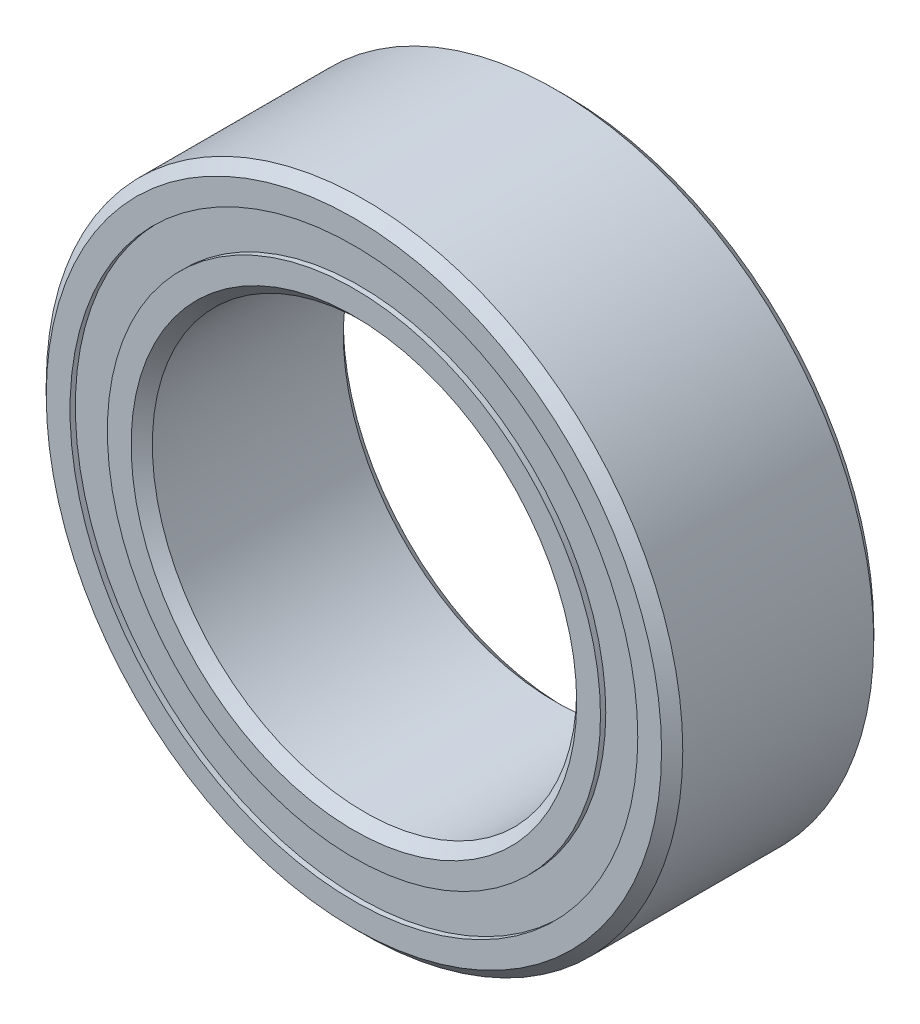
ISO-10303-21;
HEADER;
FILE_DESCRIPTION(('STEP AP214'),'2;1');
FILE_NAME('part.step','',(''),(''),'','','');
FILE_SCHEMA(('AUTOMOTIVE_DESIGN { 1 0 10303 214 1 1 1 1 }'));
ENDSEC;
DATA;
#1=APPLICATION_CONTEXT('core data for automotive mechanical design processes');
#2=APPLICATION_PROTOCOL_DEFINITION('international standard','automotive_design',2000,#1);
#3=PRODUCT_CONTEXT('',#1,'mechanical');
#4=PRODUCT('Part','Part','',(#3));
#5=PRODUCT_RELATED_PRODUCT_CATEGORY('part','',(#4));
#6=PRODUCT_DEFINITION_FORMATION('','',#4);
#7=PRODUCT_DEFINITION_CONTEXT('part definition',#1,'design');
#8=PRODUCT_DEFINITION('design','',#6,#7);
#9=PRODUCT_DEFINITION_SHAPE('','',#8);
#10=(LENGTH_UNIT() NAMED_UNIT(*) SI_UNIT(.MILLI.,.METRE.));
#11=(NAMED_UNIT(*) PLANE_ANGLE_UNIT() SI_UNIT($,.RADIAN.));
#12=(NAMED_UNIT(*) SI_UNIT($,.STERADIAN.) SOLID_ANGLE_UNIT());
#13=UNCERTAINTY_MEASURE_WITH_UNIT(LENGTH_MEASURE(1.E-05),#10,'distance_accuracy_value','');
#14=(GEOMETRIC_REPRESENTATION_CONTEXT(3) GLOBAL_UNCERTAINTY_ASSIGNED_CONTEXT((#13)) GLOBAL_UNIT_ASSIGNED_CONTEXT((#10,
#11,#12)) REPRESENTATION_CONTEXT('',''));
#15=CARTESIAN_POINT('',(0.,0.,0.));
#16=DIRECTION('',(0.,0.,1.));
#17=DIRECTION('',(1.,0.,0.));
#18=AXIS2_PLACEMENT_3D('',#15,#16,#17);
#19=CARTESIAN_POINT('',(0.,3.96875,0.));
#20=DIRECTION('',(0.,1.,0.));
#21=DIRECTION('',(0.,0.,-1.));
#22=AXIS2_PLACEMENT_3D('',#19,#20,#21);
#23=SPHERICAL_SURFACE('',#22,0.758760243513404);
#24=CARTESIAN_POINT('',(0.,3.2099897564866,0.));
#25=VERTEX_POINT('',#24);
#26=VERTEX_LOOP('',#25);
#27=FACE_BOUND('',#26,.T.);
#28=CARTESIAN_POINT('',(0.,4.7275102435134,0.));
#29=VERTEX_POINT('',#28);
#30=VERTEX_LOOP('',#29);
#31=FACE_BOUND('',#30,.T.);
#32=ADVANCED_FACE('P0_F16',(#27,#31),#23,.T.);
#33=CLOSED_SHELL('',(#32));
#34=MANIFOLD_SOLID_BREP('P0_B1',#33);
#35=CARTESIAN_POINT('',(-1.98437500000003,-3.43703832126947,0.));
#36=DIRECTION('',(-0.500000000000007,-0.866025403784435,0.));
#37=DIRECTION('',(0.,0.,-1.));
#38=AXIS2_PLACEMENT_3D('',#35,#36,#37);
#39=SPHERICAL_SURFACE('',#38,0.758760243513404);
#40=CARTESIAN_POINT('',(-2.36375512175674,-4.09414396753375,0.));
#41=VERTEX_POINT('',#40);
#42=VERTEX_LOOP('',#41);
#43=FACE_BOUND('',#42,.T.);
#44=CARTESIAN_POINT('',(-1.60499487824332,-2.7799326750052,0.));
#45=VERTEX_POINT('',#44);
#46=VERTEX_LOOP('',#45);
#47=FACE_BOUND('',#46,.T.);
#48=ADVANCED_FACE('P1_F16',(#43,#47),#39,.T.);
#49=CLOSED_SHELL('',(#48));
#50=MANIFOLD_SOLID_BREP('P1_B1',#49);
#51=CARTESIAN_POINT('',(0.,0.,0.));
#52=DIRECTION('',(0.,0.,1.));
#53=DIRECTION('',(1.,0.,0.));
#54=AXIS2_PLACEMENT_3D('',#51,#52,#53);
#55=TOROIDAL_SURFACE('',#54,3.96875,0.758760243513404);
#56=CARTESIAN_POINT('',(0.,0.,-0.705555555555556));
#57=DIRECTION('',(0.,0.,1.));
#58=DIRECTION('',(1.,0.,0.));
#59=AXIS2_PLACEMENT_3D('',#56,#57,#58);
#60=CIRCLE('',#59,4.24787087912088);
#61=CARTESIAN_POINT('',(4.24787087912088,0.,-0.705555555555556));
#62=VERTEX_POINT('',#61);
#63=EDGE_CURVE('P2_E33',#62,#62,#60,.F.);
#64=ORIENTED_EDGE('',*,*,#63,.T.);
#65=EDGE_LOOP('',(#64));
#66=FACE_BOUND('',#65,.T.);
#67=CARTESIAN_POINT('',(0.,0.,0.705555555555555));
#68=DIRECTION('',(0.,0.,1.));
#69=DIRECTION('',(1.,0.,0.));
#70=AXIS2_PLACEMENT_3D('',#67,#68,#69);
#71=CIRCLE('',#70,4.24787087912088);
#72=CARTESIAN_POINT('',(4.24787087912088,0.,0.705555555555555));
#73=VERTEX_POINT('',#72);
#74=EDGE_CURVE('P2_E31',#73,#73,#71,.T.);
#75=ORIENTED_EDGE('',*,*,#74,.T.);
#76=EDGE_LOOP('',(#75));
#77=FACE_BOUND('',#76,.T.);
#78=ADVANCED_FACE('P2_F15',(#66,#77),#55,.F.);
#79=CARTESIAN_POINT('',(0.,0.,1.5875));
#80=DIRECTION('',(0.,0.,1.));
#81=DIRECTION('',(1.,0.,0.));
#82=AXIS2_PLACEMENT_3D('',#79,#80,#81);
#83=CYLINDRICAL_SURFACE('',#82,4.24787087912088);
#84=CARTESIAN_POINT('',(0.,0.,-1.5875));
#85=DIRECTION('',(0.,0.,1.));
#86=DIRECTION('',(1.,0.,0.));
#87=AXIS2_PLACEMENT_3D('',#84,#85,#86);
#88=CIRCLE('',#87,4.24787087912088);
#89=CARTESIAN_POINT('',(4.24787087912088,0.,-1.5875));
#90=VERTEX_POINT('',#89);
#91=EDGE_CURVE('P2_E19',#90,#90,#88,.F.);
#92=ORIENTED_EDGE('',*,*,#91,.T.);
#93=EDGE_LOOP('',(#92));
#94=FACE_BOUND('',#93,.T.);
#95=ORIENTED_EDGE('',*,*,#63,.F.);
#96=EDGE_LOOP('',(#95));
#97=FACE_BOUND('',#96,.T.);
#98=ADVANCED_FACE('P2_F49',(#94,#97),#83,.F.);
#99=CARTESIAN_POINT('',(0.,0.,1.5875));
#100=DIRECTION('',(0.,0.,1.));
#101=DIRECTION('',(1.,0.,0.));
#102=AXIS2_PLACEMENT_3D('',#99,#100,#101);
#103=CYLINDRICAL_SURFACE('',#102,4.24787087912088);
#104=ORIENTED_EDGE('',*,*,#74,.F.);
#105=EDGE_LOOP('',(#104));
#106=FACE_BOUND('',#105,.T.);
#107=CARTESIAN_POINT('',(0.,0.,1.5875));
#108=DIRECTION('',(0.,0.,1.));
#109=DIRECTION('',(1.,0.,0.));
#110=AXIS2_PLACEMENT_3D('',#107,#108,#109);
#111=CIRCLE('',#110,4.24787087912088);
#112=CARTESIAN_POINT('',(4.24787087912088,0.,1.5875));
#113=VERTEX_POINT('',#112);
#114=EDGE_CURVE('P2_E42',#113,#113,#111,.T.);
#115=ORIENTED_EDGE('',*,*,#114,.T.);
#116=EDGE_LOOP('',(#115));
#117=FACE_BOUND('',#116,.T.);
#118=ADVANCED_FACE('P2_F56',(#106,#117),#103,.F.);
#119=CARTESIAN_POINT('',(0.,4.60375,-1.5875));
#120=DIRECTION('',(0.,0.,1.));
#121=DIRECTION('',(1.,0.,0.));
#122=AXIS2_PLACEMENT_3D('',#119,#120,#121);
#123=PLANE('',#122);
#124=ORIENTED_EDGE('',*,*,#91,.F.);
#125=EDGE_LOOP('',(#124));
#126=FACE_BOUND('',#125,.T.);
#127=CARTESIAN_POINT('',(0.,0.,-1.58750000008467));
#128=DIRECTION('',(0.,0.,1.));
#129=DIRECTION('',(1.,0.,0.));
#130=AXIS2_PLACEMENT_3D('',#127,#128,#129);
#131=CIRCLE('',#130,4.60375000000113);
#132=CARTESIAN_POINT('',(4.60375000000113,0.,-1.58750000008467));
#133=VERTEX_POINT('',#132);
#134=EDGE_CURVE('P2_E40',#133,#133,#131,.T.);
#135=ORIENTED_EDGE('',*,*,#134,.F.);
#136=EDGE_LOOP('',(#135));
#137=FACE_BOUND('',#136,.T.);
#138=ADVANCED_FACE('P2_F52',(#126,#137),#123,.F.);
#139=CARTESIAN_POINT('',(0.,4.60375,1.5875));
#140=DIRECTION('',(0.,0.,-1.));
#141=DIRECTION('',(-1.,0.,0.));
#142=AXIS2_PLACEMENT_3D('',#139,#140,#141);
#143=PLANE('',#142);
#144=CARTESIAN_POINT('',(0.,0.,1.58750000008467));
#145=DIRECTION('',(0.,0.,-1.));
#146=DIRECTION('',(-1.,0.,0.));
#147=AXIS2_PLACEMENT_3D('',#144,#145,#146);
#148=CIRCLE('',#147,4.60375000000113);
#149=CARTESIAN_POINT('',(-4.60375000000113,0.,1.58750000008467));
#150=VERTEX_POINT('',#149);
#151=EDGE_CURVE('P2_E28',#150,#150,#148,.T.);
#152=ORIENTED_EDGE('',*,*,#151,.F.);
#153=EDGE_LOOP('',(#152));
#154=FACE_BOUND('',#153,.T.);
#155=ORIENTED_EDGE('',*,*,#114,.F.);
#156=EDGE_LOOP('',(#155));
#157=FACE_BOUND('',#156,.T.);
#158=ADVANCED_FACE('P2_F55',(#154,#157),#143,.F.);
#159=CARTESIAN_POINT('',(0.,0.,-1.42875000000231));
#160=DIRECTION('',(0.,0.,1.));
#161=DIRECTION('',(1.,0.,0.));
#162=AXIS2_PLACEMENT_3D('',#159,#160,#161);
#163=CONICAL_SURFACE('',#162,4.76250000002665,0.785398163218414);
#164=CARTESIAN_POINT('',(0.,0.,-1.42875));
#165=DIRECTION('',(0.,0.,1.));
#166=DIRECTION('',(1.,0.,0.));
#167=AXIS2_PLACEMENT_3D('',#164,#165,#166);
#168=CIRCLE('',#167,4.7625);
#169=CARTESIAN_POINT('',(4.7625,0.,-1.42875));
#170=VERTEX_POINT('',#169);
#171=EDGE_CURVE('P2_E23',#170,#170,#168,.T.);
#172=ORIENTED_EDGE('',*,*,#171,.F.);
#173=EDGE_LOOP('',(#172));
#174=FACE_BOUND('',#173,.T.);
#175=ORIENTED_EDGE('',*,*,#134,.T.);
#176=EDGE_LOOP('',(#175));
#177=FACE_BOUND('',#176,.T.);
#178=ADVANCED_FACE('P2_F60',(#174,#177),#163,.T.);
#179=CARTESIAN_POINT('',(0.,0.,1.42875000005915));
#180=DIRECTION('',(0.,0.,-1.));
#181=DIRECTION('',(-1.,0.,0.));
#182=AXIS2_PLACEMENT_3D('',#179,#180,#181);
#183=CONICAL_SURFACE('',#182,4.7624999999698,0.785398163218414);
#184=CARTESIAN_POINT('',(0.,0.,1.42875));
#185=DIRECTION('',(0.,0.,1.));
#186=DIRECTION('',(1.,0.,0.));
#187=AXIS2_PLACEMENT_3D('',#184,#185,#186);
#188=CIRCLE('',#187,4.7625);
#189=CARTESIAN_POINT('',(4.7625,0.,1.42875));
#190=VERTEX_POINT('',#189);
#191=EDGE_CURVE('P2_E10',#190,#190,#188,.F.);
#192=ORIENTED_EDGE('',*,*,#191,.F.);
#193=EDGE_LOOP('',(#192));
#194=FACE_BOUND('',#193,.T.);
#195=ORIENTED_EDGE('',*,*,#151,.T.);
#196=EDGE_LOOP('',(#195));
#197=FACE_BOUND('',#196,.T.);
#198=ADVANCED_FACE('P2_F62',(#194,#197),#183,.T.);
#199=CARTESIAN_POINT('',(0.,0.,1.5875));
#200=DIRECTION('',(0.,0.,1.));
#201=DIRECTION('',(1.,0.,0.));
#202=AXIS2_PLACEMENT_3D('',#199,#200,#201);
#203=CYLINDRICAL_SURFACE('',#202,4.7625);
#204=ORIENTED_EDGE('',*,*,#191,.T.);
#205=EDGE_LOOP('',(#204));
#206=FACE_BOUND('',#205,.T.);
#207=ORIENTED_EDGE('',*,*,#171,.T.);
#208=EDGE_LOOP('',(#207));
#209=FACE_BOUND('',#208,.T.);
#210=ADVANCED_FACE('P2_F70',(#206,#209),#203,.T.);
#211=CLOSED_SHELL('',(#78,#98,#118,#138,#158,#178,#198,#210));
#212=MANIFOLD_SOLID_BREP('P2_B1',#211);
#213=CARTESIAN_POINT('',(0.,4.24787087912088,0.758760243513404));
#214=DIRECTION('',(0.,0.,1.));
#215=DIRECTION('',(1.,0.,0.));
#216=AXIS2_PLACEMENT_3D('',#213,#214,#215);
#217=PLANE('',#216);
#218=CARTESIAN_POINT('',(0.,0.,0.758760243513404));
#219=DIRECTION('',(0.,0.,1.));
#220=DIRECTION('',(1.,0.,0.));
#221=AXIS2_PLACEMENT_3D('',#218,#219,#220);
#222=CIRCLE('',#221,3.68962912087912);
#223=CARTESIAN_POINT('',(3.68962912087912,0.,0.758760243513404));
#224=VERTEX_POINT('',#223);
#225=EDGE_CURVE('P3_E18',#224,#224,#222,.T.);
#226=ORIENTED_EDGE('',*,*,#225,.T.);
#227=EDGE_LOOP('',(#226));
#228=FACE_BOUND('',#227,.T.);
#229=CARTESIAN_POINT('',(0.,0.,0.758760243513404));
#230=DIRECTION('',(0.,0.,1.));
#231=DIRECTION('',(1.,0.,0.));
#232=AXIS2_PLACEMENT_3D('',#229,#230,#231);
#233=CIRCLE('',#232,4.24787087912088);
#234=CARTESIAN_POINT('',(4.24787087912088,0.,0.758760243513404));
#235=VERTEX_POINT('',#234);
#236=EDGE_CURVE('P3_E27',#235,#235,#233,.T.);
#237=ORIENTED_EDGE('',*,*,#236,.F.);
#238=EDGE_LOOP('',(#237));
#239=FACE_BOUND('',#238,.T.);
#240=ADVANCED_FACE('P3_F15',(#228,#239),#217,.F.);
#241=CARTESIAN_POINT('',(0.,0.,1.5875));
#242=DIRECTION('',(0.,0.,1.));
#243=DIRECTION('',(1.,0.,0.));
#244=AXIS2_PLACEMENT_3D('',#241,#242,#243);
#245=CYLINDRICAL_SURFACE('',#244,3.68962912087912);
#246=ORIENTED_EDGE('',*,*,#225,.F.);
#247=EDGE_LOOP('',(#246));
#248=FACE_BOUND('',#247,.T.);
#249=CARTESIAN_POINT('',(0.,0.,1.508125));
#250=DIRECTION('',(0.,0.,1.));
#251=DIRECTION('',(1.,0.,0.));
#252=AXIS2_PLACEMENT_3D('',#249,#250,#251);
#253=CIRCLE('',#252,3.68962912087912);
#254=CARTESIAN_POINT('',(3.68962912087912,0.,1.508125));
#255=VERTEX_POINT('',#254);
#256=EDGE_CURVE('P3_E22',#255,#255,#253,.T.);
#257=ORIENTED_EDGE('',*,*,#256,.T.);
#258=EDGE_LOOP('',(#257));
#259=FACE_BOUND('',#258,.T.);
#260=ADVANCED_FACE('P3_F37',(#248,#259),#245,.F.);
#261=CARTESIAN_POINT('',(0.,0.,1.5875));
#262=DIRECTION('',(0.,0.,1.));
#263=DIRECTION('',(1.,0.,0.));
#264=AXIS2_PLACEMENT_3D('',#261,#262,#263);
#265=CYLINDRICAL_SURFACE('',#264,4.24787087912088);
#266=CARTESIAN_POINT('',(0.,0.,1.508125));
#267=DIRECTION('',(0.,0.,1.));
#268=DIRECTION('',(1.,0.,0.));
#269=AXIS2_PLACEMENT_3D('',#266,#267,#268);
#270=CIRCLE('',#269,4.24787087912088);
#271=CARTESIAN_POINT('',(4.24787087912088,0.,1.508125));
#272=VERTEX_POINT('',#271);
#273=EDGE_CURVE('P3_E10',#272,#272,#270,.F.);
#274=ORIENTED_EDGE('',*,*,#273,.T.);
#275=EDGE_LOOP('',(#274));
#276=FACE_BOUND('',#275,.T.);
#277=ORIENTED_EDGE('',*,*,#236,.T.);
#278=EDGE_LOOP('',(#277));
#279=FACE_BOUND('',#278,.T.);
#280=ADVANCED_FACE('P3_F40',(#276,#279),#265,.T.);
#281=CARTESIAN_POINT('',(0.,4.24787087912088,1.508125));
#282=DIRECTION('',(0.,0.,-1.));
#283=DIRECTION('',(-1.,0.,0.));
#284=AXIS2_PLACEMENT_3D('',#281,#282,#283);
#285=PLANE('',#284);
#286=ORIENTED_EDGE('',*,*,#273,.F.);
#287=EDGE_LOOP('',(#286));
#288=FACE_BOUND('',#287,.T.);
#289=ORIENTED_EDGE('',*,*,#256,.F.);
#290=EDGE_LOOP('',(#289));
#291=FACE_BOUND('',#290,.T.);
#292=ADVANCED_FACE('P3_F43',(#288,#291),#285,.F.);
#293=CLOSED_SHELL('',(#240,#260,#280,#292));
#294=MANIFOLD_SOLID_BREP('P3_B1',#293);
#295=CARTESIAN_POINT('',(-3.43703832126947,1.98437500000004,0.));
#296=DIRECTION('',(-0.866025403784433,0.50000000000001,0.));
#297=DIRECTION('',(0.,0.,-1.));
#298=AXIS2_PLACEMENT_3D('',#295,#296,#297);
#299=SPHERICAL_SURFACE('',#298,0.758760243513404);
#300=CARTESIAN_POINT('',(-4.09414396753374,2.36375512175675,0.));
#301=VERTEX_POINT('',#300);
#302=VERTEX_LOOP('',#301);
#303=FACE_BOUND('',#302,.T.);
#304=CARTESIAN_POINT('',(-2.7799326750052,1.60499487824333,0.));
#305=VERTEX_POINT('',#304);
#306=VERTEX_LOOP('',#305);
#307=FACE_BOUND('',#306,.T.);
#308=ADVANCED_FACE('P4_F16',(#303,#307),#299,.T.);
#309=CLOSED_SHELL('',(#308));
#310=MANIFOLD_SOLID_BREP('P4_B1',#309);
#311=CARTESIAN_POINT('',(-3.96875,0.,0.));
#312=DIRECTION('',(-1.,0.,0.));
#313=DIRECTION('',(0.,0.,-1.));
#314=AXIS2_PLACEMENT_3D('',#311,#312,#313);
#315=SPHERICAL_SURFACE('',#314,0.758760243513404);
#316=CARTESIAN_POINT('',(-4.7275102435134,0.,0.));
#317=VERTEX_POINT('',#316);
#318=VERTEX_LOOP('',#317);
#319=FACE_BOUND('',#318,.T.);
#320=CARTESIAN_POINT('',(-3.2099897564866,0.,0.));
#321=VERTEX_POINT('',#320);
#322=VERTEX_LOOP('',#321);
#323=FACE_BOUND('',#322,.T.);
#324=ADVANCED_FACE('P5_F16',(#319,#323),#315,.T.);
#325=CLOSED_SHELL('',(#324));
#326=MANIFOLD_SOLID_BREP('P5_B1',#325);
#327=CARTESIAN_POINT('',(3.96875,0.,0.));
#328=DIRECTION('',(1.,0.,0.));
#329=DIRECTION('',(0.,0.,-1.));
#330=AXIS2_PLACEMENT_3D('',#327,#328,#329);
#331=SPHERICAL_SURFACE('',#330,0.758760243513404);
#332=CARTESIAN_POINT('',(3.2099897564866,0.,0.));
#333=VERTEX_POINT('',#332);
#334=VERTEX_LOOP('',#333);
#335=FACE_BOUND('',#334,.T.);
#336=CARTESIAN_POINT('',(4.7275102435134,0.,0.));
#337=VERTEX_POINT('',#336);
#338=VERTEX_LOOP('',#337);
#339=FACE_BOUND('',#338,.T.);
#340=ADVANCED_FACE('P6_F16',(#335,#339),#331,.T.);
#341=CLOSED_SHELL('',(#340));
#342=MANIFOLD_SOLID_BREP('P6_B1',#341);
#343=CARTESIAN_POINT('',(0.,4.24787087912088,-1.508125));
#344=DIRECTION('',(0.,0.,1.));
#345=DIRECTION('',(1.,0.,0.));
#346=AXIS2_PLACEMENT_3D('',#343,#344,#345);
#347=PLANE('',#346);
#348=CARTESIAN_POINT('',(0.,0.,-1.508125));
#349=DIRECTION('',(0.,0.,1.));
#350=DIRECTION('',(1.,0.,0.));
#351=AXIS2_PLACEMENT_3D('',#348,#349,#350);
#352=CIRCLE('',#351,3.68962912087912);
#353=CARTESIAN_POINT('',(3.68962912087912,0.,-1.508125));
#354=VERTEX_POINT('',#353);
#355=EDGE_CURVE('P7_E18',#354,#354,#352,.T.);
#356=ORIENTED_EDGE('',*,*,#355,.T.);
#357=EDGE_LOOP('',(#356));
#358=FACE_BOUND('',#357,.T.);
#359=CARTESIAN_POINT('',(0.,0.,-1.508125));
#360=DIRECTION('',(0.,0.,1.));
#361=DIRECTION('',(1.,0.,0.));
#362=AXIS2_PLACEMENT_3D('',#359,#360,#361);
#363=CIRCLE('',#362,4.24787087912088);
#364=CARTESIAN_POINT('',(4.24787087912088,0.,-1.508125));
#365=VERTEX_POINT('',#364);
#366=EDGE_CURVE('P7_E27',#365,#365,#363,.T.);
#367=ORIENTED_EDGE('',*,*,#366,.F.);
#368=EDGE_LOOP('',(#367));
#369=FACE_BOUND('',#368,.T.);
#370=ADVANCED_FACE('P7_F15',(#358,#369),#347,.F.);
#371=CARTESIAN_POINT('',(0.,0.,1.5875));
#372=DIRECTION('',(0.,0.,1.));
#373=DIRECTION('',(1.,0.,0.));
#374=AXIS2_PLACEMENT_3D('',#371,#372,#373);
#375=CYLINDRICAL_SURFACE('',#374,3.68962912087912);
#376=ORIENTED_EDGE('',*,*,#355,.F.);
#377=EDGE_LOOP('',(#376));
#378=FACE_BOUND('',#377,.T.);
#379=CARTESIAN_POINT('',(0.,0.,-0.758760243513405));
#380=DIRECTION('',(0.,0.,1.));
#381=DIRECTION('',(1.,0.,0.));
#382=AXIS2_PLACEMENT_3D('',#379,#380,#381);
#383=CIRCLE('',#382,3.68962912087912);
#384=CARTESIAN_POINT('',(3.68962912087912,0.,-0.758760243513405));
#385=VERTEX_POINT('',#384);
#386=EDGE_CURVE('P7_E22',#385,#385,#383,.T.);
#387=ORIENTED_EDGE('',*,*,#386,.T.);
#388=EDGE_LOOP('',(#387));
#389=FACE_BOUND('',#388,.T.);
#390=ADVANCED_FACE('P7_F37',(#378,#389),#375,.F.);
#391=CARTESIAN_POINT('',(0.,0.,1.5875));
#392=DIRECTION('',(0.,0.,1.));
#393=DIRECTION('',(1.,0.,0.));
#394=AXIS2_PLACEMENT_3D('',#391,#392,#393);
#395=CYLINDRICAL_SURFACE('',#394,4.24787087912088);
#396=CARTESIAN_POINT('',(0.,0.,-0.758760243513404));
#397=DIRECTION('',(0.,0.,1.));
#398=DIRECTION('',(1.,0.,0.));
#399=AXIS2_PLACEMENT_3D('',#396,#397,#398);
#400=CIRCLE('',#399,4.24787087912088);
#401=CARTESIAN_POINT('',(4.24787087912088,0.,-0.758760243513404));
#402=VERTEX_POINT('',#401);
#403=EDGE_CURVE('P7_E10',#402,#402,#400,.F.);
#404=ORIENTED_EDGE('',*,*,#403,.T.);
#405=EDGE_LOOP('',(#404));
#406=FACE_BOUND('',#405,.T.);
#407=ORIENTED_EDGE('',*,*,#366,.T.);
#408=EDGE_LOOP('',(#407));
#409=FACE_BOUND('',#408,.T.);
#410=ADVANCED_FACE('P7_F40',(#406,#409),#395,.T.);
#411=CARTESIAN_POINT('',(0.,4.24787087912088,-0.758760243513404));
#412=DIRECTION('',(0.,0.,-1.));
#413=DIRECTION('',(-1.,0.,0.));
#414=AXIS2_PLACEMENT_3D('',#411,#412,#413);
#415=PLANE('',#414);
#416=ORIENTED_EDGE('',*,*,#403,.F.);
#417=EDGE_LOOP('',(#416));
#418=FACE_BOUND('',#417,.T.);
#419=ORIENTED_EDGE('',*,*,#386,.F.);
#420=EDGE_LOOP('',(#419));
#421=FACE_BOUND('',#420,.T.);
#422=ADVANCED_FACE('P7_F43',(#418,#421),#415,.F.);
#423=CLOSED_SHELL('',(#370,#390,#410,#422));
#424=MANIFOLD_SOLID_BREP('P7_B1',#423);
#425=CARTESIAN_POINT('',(3.43703832126948,-1.98437500000002,0.));
#426=DIRECTION('',(0.866025403784437,-0.500000000000004,0.));
#427=DIRECTION('',(0.,0.,-1.));
#428=AXIS2_PLACEMENT_3D('',#425,#426,#427);
#429=SPHERICAL_SURFACE('',#428,0.758760243513404);
#430=CARTESIAN_POINT('',(4.09414396753376,-2.36375512175672,0.));
#431=VERTEX_POINT('',#430);
#432=VERTEX_LOOP('',#431);
#433=FACE_BOUND('',#432,.T.);
#434=CARTESIAN_POINT('',(2.77993267500521,-1.60499487824331,0.));
#435=VERTEX_POINT('',#434);
#436=VERTEX_LOOP('',#435);
#437=FACE_BOUND('',#436,.T.);
#438=ADVANCED_FACE('P8_F16',(#433,#437),#429,.T.);
#439=CLOSED_SHELL('',(#438));
#440=MANIFOLD_SOLID_BREP('P8_B1',#439);
#441=CARTESIAN_POINT('',(1.98437499999998,-3.4370383212695,0.));
#442=DIRECTION('',(0.499999999999995,-0.866025403784442,0.));
#443=DIRECTION('',(0.,0.,-1.));
#444=AXIS2_PLACEMENT_3D('',#441,#442,#443);
#445=SPHERICAL_SURFACE('',#444,0.758760243513404);
#446=CARTESIAN_POINT('',(1.60499487824328,-2.77993267500523,0.));
#447=VERTEX_POINT('',#446);
#448=VERTEX_LOOP('',#447);
#449=FACE_BOUND('',#448,.T.);
#450=CARTESIAN_POINT('',(2.36375512175668,-4.09414396753378,0.));
#451=VERTEX_POINT('',#450);
#452=VERTEX_LOOP('',#451);
#453=FACE_BOUND('',#452,.T.);
#454=ADVANCED_FACE('P9_F16',(#449,#453),#445,.T.);
#455=CLOSED_SHELL('',(#454));
#456=MANIFOLD_SOLID_BREP('P9_B1',#455);
#457=CARTESIAN_POINT('',(3.4370383212695,1.98437499999999,0.));
#458=DIRECTION('',(0.86602540378444,0.499999999999998,0.));
#459=DIRECTION('',(0.,0.,-1.));
#460=AXIS2_PLACEMENT_3D('',#457,#458,#459);
#461=SPHERICAL_SURFACE('',#460,0.758760243513404);
#462=CARTESIAN_POINT('',(4.09414396753377,2.36375512175669,0.));
#463=VERTEX_POINT('',#462);
#464=VERTEX_LOOP('',#463);
#465=FACE_BOUND('',#464,.T.);
#466=CARTESIAN_POINT('',(2.77993267500522,1.60499487824329,0.));
#467=VERTEX_POINT('',#466);
#468=VERTEX_LOOP('',#467);
#469=FACE_BOUND('',#468,.T.);
#470=ADVANCED_FACE('P10_F16',(#465,#469),#461,.T.);
#471=CLOSED_SHELL('',(#470));
#472=MANIFOLD_SOLID_BREP('P10_B1',#471);
#473=CARTESIAN_POINT('',(-1.98437499999996,3.43703832126952,0.));
#474=DIRECTION('',(-0.499999999999989,0.866025403784445,0.));
#475=DIRECTION('',(0.,0.,-1.));
#476=AXIS2_PLACEMENT_3D('',#473,#474,#475);
#477=SPHERICAL_SURFACE('',#476,0.758760243513404);
#478=CARTESIAN_POINT('',(-2.36375512175665,4.0941439675338,0.));
#479=VERTEX_POINT('',#478);
#480=VERTEX_LOOP('',#479);
#481=FACE_BOUND('',#480,.T.);
#482=CARTESIAN_POINT('',(-1.60499487824326,2.77993267500524,0.));
#483=VERTEX_POINT('',#482);
#484=VERTEX_LOOP('',#483);
#485=FACE_BOUND('',#484,.T.);
#486=ADVANCED_FACE('P11_F16',(#481,#485),#477,.T.);
#487=CLOSED_SHELL('',(#486));
#488=MANIFOLD_SOLID_BREP('P11_B1',#487);
#489=CARTESIAN_POINT('',(0.,0.,0.));
#490=DIRECTION('',(0.,0.,1.));
#491=DIRECTION('',(1.,0.,0.));
#492=AXIS2_PLACEMENT_3D('',#489,#490,#491);
#493=TOROIDAL_SURFACE('',#492,3.96875,0.758760243513403);
#494=CARTESIAN_POINT('',(0.,0.,0.705555555555556));
#495=DIRECTION('',(0.,0.,1.));
#496=DIRECTION('',(1.,0.,0.));
#497=AXIS2_PLACEMENT_3D('',#494,#495,#496);
#498=CIRCLE('',#497,3.68962912087912);
#499=CARTESIAN_POINT('',(3.68962912087912,0.,0.705555555555556));
#500=VERTEX_POINT('',#499);
#501=EDGE_CURVE('P12_E33',#500,#500,#498,.T.);
#502=ORIENTED_EDGE('',*,*,#501,.F.);
#503=EDGE_LOOP('',(#502));
#504=FACE_BOUND('',#503,.T.);
#505=CARTESIAN_POINT('',(0.,0.,-0.705555555555556));
#506=DIRECTION('',(0.,0.,1.));
#507=DIRECTION('',(1.,0.,0.));
#508=AXIS2_PLACEMENT_3D('',#505,#506,#507);
#509=CIRCLE('',#508,3.68962912087912);
#510=CARTESIAN_POINT('',(3.68962912087912,0.,-0.705555555555556));
#511=VERTEX_POINT('',#510);
#512=EDGE_CURVE('P12_E31',#511,#511,#509,.F.);
#513=ORIENTED_EDGE('',*,*,#512,.F.);
#514=EDGE_LOOP('',(#513));
#515=FACE_BOUND('',#514,.T.);
#516=ADVANCED_FACE('P12_F15',(#504,#515),#493,.F.);
#517=CARTESIAN_POINT('',(0.,0.,1.5875));
#518=DIRECTION('',(0.,0.,1.));
#519=DIRECTION('',(1.,0.,0.));
#520=AXIS2_PLACEMENT_3D('',#517,#518,#519);
#521=CYLINDRICAL_SURFACE('',#520,3.68962912087912);
#522=CARTESIAN_POINT('',(0.,0.,1.5875));
#523=DIRECTION('',(0.,0.,1.));
#524=DIRECTION('',(1.,0.,0.));
#525=AXIS2_PLACEMENT_3D('',#522,#523,#524);
#526=CIRCLE('',#525,3.68962912087912);
#527=CARTESIAN_POINT('',(3.68962912087912,0.,1.5875));
#528=VERTEX_POINT('',#527);
#529=EDGE_CURVE('P12_E19',#528,#528,#526,.F.);
#530=ORIENTED_EDGE('',*,*,#529,.T.);
#531=EDGE_LOOP('',(#530));
#532=FACE_BOUND('',#531,.T.);
#533=ORIENTED_EDGE('',*,*,#501,.T.);
#534=EDGE_LOOP('',(#533));
#535=FACE_BOUND('',#534,.T.);
#536=ADVANCED_FACE('P12_F49',(#532,#535),#521,.T.);
#537=CARTESIAN_POINT('',(0.,0.,1.5875));
#538=DIRECTION('',(0.,0.,1.));
#539=DIRECTION('',(1.,0.,0.));
#540=AXIS2_PLACEMENT_3D('',#537,#538,#539);
#541=CYLINDRICAL_SURFACE('',#540,3.68962912087912);
#542=ORIENTED_EDGE('',*,*,#512,.T.);
#543=EDGE_LOOP('',(#542));
#544=FACE_BOUND('',#543,.T.);
#545=CARTESIAN_POINT('',(0.,0.,-1.5875));
#546=DIRECTION('',(0.,0.,1.));
#547=DIRECTION('',(1.,0.,0.));
#548=AXIS2_PLACEMENT_3D('',#545,#546,#547);
#549=CIRCLE('',#548,3.68962912087912);
#550=CARTESIAN_POINT('',(3.68962912087912,0.,-1.5875));
#551=VERTEX_POINT('',#550);
#552=EDGE_CURVE('P12_E42',#551,#551,#549,.T.);
#553=ORIENTED_EDGE('',*,*,#552,.T.);
#554=EDGE_LOOP('',(#553));
#555=FACE_BOUND('',#554,.T.);
#556=ADVANCED_FACE('P12_F56',(#544,#555),#541,.T.);
#557=CARTESIAN_POINT('',(0.,3.68962912087912,1.5875));
#558=DIRECTION('',(0.,0.,-1.));
#559=DIRECTION('',(-1.,0.,0.));
#560=AXIS2_PLACEMENT_3D('',#557,#558,#559);
#561=PLANE('',#560);
#562=ORIENTED_EDGE('',*,*,#529,.F.);
#563=EDGE_LOOP('',(#562));
#564=FACE_BOUND('',#563,.T.);
#565=CARTESIAN_POINT('',(0.,0.,1.58749999997099));
#566=DIRECTION('',(0.,0.,1.));
#567=DIRECTION('',(1.,0.,0.));
#568=AXIS2_PLACEMENT_3D('',#565,#566,#567);
#569=CIRCLE('',#568,3.33374999996749);
#570=CARTESIAN_POINT('',(3.33374999996749,0.,1.58749999997099));
#571=VERTEX_POINT('',#570);
#572=EDGE_CURVE('P12_E40',#571,#571,#569,.F.);
#573=ORIENTED_EDGE('',*,*,#572,.T.);
#574=EDGE_LOOP('',(#573));
#575=FACE_BOUND('',#574,.T.);
#576=ADVANCED_FACE('P12_F52',(#564,#575),#561,.F.);
#577=CARTESIAN_POINT('',(0.,3.33375,-1.5875));
#578=DIRECTION('',(0.,0.,1.));
#579=DIRECTION('',(1.,0.,0.));
#580=AXIS2_PLACEMENT_3D('',#577,#578,#579);
#581=PLANE('',#580);
#582=CARTESIAN_POINT('',(0.,0.,-1.58749999997099));
#583=DIRECTION('',(0.,0.,-1.));
#584=DIRECTION('',(0.,1.,0.));
#585=AXIS2_PLACEMENT_3D('',#582,#583,#584);
#586=CIRCLE('',#585,3.33375000002434);
#587=CARTESIAN_POINT('',(0.,3.33375000002434,-1.58749999997099));
#588=VERTEX_POINT('',#587);
#589=EDGE_CURVE('P12_E28',#588,#588,#586,.F.);
#590=ORIENTED_EDGE('',*,*,#589,.T.);
#591=EDGE_LOOP('',(#590));
#592=FACE_BOUND('',#591,.T.);
#593=ORIENTED_EDGE('',*,*,#552,.F.);
#594=EDGE_LOOP('',(#593));
#595=FACE_BOUND('',#594,.T.);
#596=ADVANCED_FACE('P12_F55',(#592,#595),#581,.F.);
#597=CARTESIAN_POINT('',(0.,0.,1.58749999991414));
#598=DIRECTION('',(0.,0.,1.));
#599=DIRECTION('',(1.,0.,0.));
#600=AXIS2_PLACEMENT_3D('',#597,#598,#599);
#601=CONICAL_SURFACE('',#600,3.33374999991065,0.785398163397448);
#602=ORIENTED_EDGE('',*,*,#572,.F.);
#603=EDGE_LOOP('',(#602));
#604=FACE_BOUND('',#603,.T.);
#605=CARTESIAN_POINT('',(0.,0.,1.42875));
#606=DIRECTION('',(0.,0.,1.));
#607=DIRECTION('',(1.,0.,0.));
#608=AXIS2_PLACEMENT_3D('',#605,#606,#607);
#609=CIRCLE('',#608,3.175);
#610=CARTESIAN_POINT('',(3.175,0.,1.42875));
#611=VERTEX_POINT('',#610);
#612=EDGE_CURVE('P12_E23',#611,#611,#609,.F.);
#613=ORIENTED_EDGE('',*,*,#612,.T.);
#614=EDGE_LOOP('',(#613));
#615=FACE_BOUND('',#614,.T.);
#616=ADVANCED_FACE('P12_F60',(#604,#615),#601,.F.);
#617=CARTESIAN_POINT('',(0.,0.,-1.58749999997099));
#618=DIRECTION('',(0.,0.,-1.));
#619=DIRECTION('',(0.,1.,0.));
#620=AXIS2_PLACEMENT_3D('',#617,#618,#619);
#621=CONICAL_SURFACE('',#620,3.33375000002434,0.785398163397448);
#622=CARTESIAN_POINT('',(0.,0.,-1.42875));
#623=DIRECTION('',(0.,0.,1.));
#624=DIRECTION('',(1.,0.,0.));
#625=AXIS2_PLACEMENT_3D('',#622,#623,#624);
#626=CIRCLE('',#625,3.175);
#627=CARTESIAN_POINT('',(3.175,0.,-1.42875));
#628=VERTEX_POINT('',#627);
#629=EDGE_CURVE('P12_E10',#628,#628,#626,.T.);
#630=ORIENTED_EDGE('',*,*,#629,.T.);
#631=EDGE_LOOP('',(#630));
#632=FACE_BOUND('',#631,.T.);
#633=ORIENTED_EDGE('',*,*,#589,.F.);
#634=EDGE_LOOP('',(#633));
#635=FACE_BOUND('',#634,.T.);
#636=ADVANCED_FACE('P12_F63',(#632,#635),#621,.F.);
#637=CARTESIAN_POINT('',(0.,0.,1.5875));
#638=DIRECTION('',(0.,0.,1.));
#639=DIRECTION('',(1.,0.,0.));
#640=AXIS2_PLACEMENT_3D('',#637,#638,#639);
#641=CYLINDRICAL_SURFACE('',#640,3.175);
#642=ORIENTED_EDGE('',*,*,#612,.F.);
#643=EDGE_LOOP('',(#642));
#644=FACE_BOUND('',#643,.T.);
#645=ORIENTED_EDGE('',*,*,#629,.F.);
#646=EDGE_LOOP('',(#645));
#647=FACE_BOUND('',#646,.T.);
#648=ADVANCED_FACE('P12_F67',(#644,#647),#641,.F.);
#649=CLOSED_SHELL('',(#516,#536,#556,#576,#596,#616,#636,#648));
#650=MANIFOLD_SOLID_BREP('P12_B1',#649);
#651=CARTESIAN_POINT('',(0.,-3.96875,0.));
#652=DIRECTION('',(0.,-1.,0.));
#653=DIRECTION('',(0.,0.,-1.));
#654=AXIS2_PLACEMENT_3D('',#651,#652,#653);
#655=SPHERICAL_SURFACE('',#654,0.758760243513404);
#656=CARTESIAN_POINT('',(0.,-3.2099897564866,0.));
#657=VERTEX_POINT('',#656);
#658=VERTEX_LOOP('',#657);
#659=FACE_BOUND('',#658,.T.);
#660=CARTESIAN_POINT('',(0.,-4.7275102435134,0.));
#661=VERTEX_POINT('',#660);
#662=VERTEX_LOOP('',#661);
#663=FACE_BOUND('',#662,.T.);
#664=ADVANCED_FACE('P13_F16',(#659,#663),#655,.T.);
#665=CLOSED_SHELL('',(#664));
#666=MANIFOLD_SOLID_BREP('P13_B1',#665);
#667=CARTESIAN_POINT('',(1.984375,3.43703832126949,0.));
#668=DIRECTION('',(0.500000000000001,0.866025403784438,0.));
#669=DIRECTION('',(0.,0.,-1.));
#670=AXIS2_PLACEMENT_3D('',#667,#668,#669);
#671=SPHERICAL_SURFACE('',#670,0.758760243513404);
#672=CARTESIAN_POINT('',(2.36375512175671,4.09414396753376,0.));
#673=VERTEX_POINT('',#672);
#674=VERTEX_LOOP('',#673);
#675=FACE_BOUND('',#674,.T.);
#676=CARTESIAN_POINT('',(1.6049948782433,2.77993267500521,0.));
#677=VERTEX_POINT('',#676);
#678=VERTEX_LOOP('',#677);
#679=FACE_BOUND('',#678,.T.);
#680=ADVANCED_FACE('P14_F16',(#675,#679),#671,.T.);
#681=CLOSED_SHELL('',(#680));
#682=MANIFOLD_SOLID_BREP('P14_B1',#681);
#683=CARTESIAN_POINT('',(-3.43703832126951,-1.98437499999997,0.));
#684=DIRECTION('',(-0.866025403784443,-0.499999999999992,0.));
#685=DIRECTION('',(0.,0.,-1.));
#686=AXIS2_PLACEMENT_3D('',#683,#684,#685);
#687=SPHERICAL_SURFACE('',#686,0.758760243513404);
#688=CARTESIAN_POINT('',(-4.09414396753379,-2.36375512175666,0.));
#689=VERTEX_POINT('',#688);
#690=VERTEX_LOOP('',#689);
#691=FACE_BOUND('',#690,.T.);
#692=CARTESIAN_POINT('',(-2.77993267500523,-1.60499487824327,0.));
#693=VERTEX_POINT('',#692);
#694=VERTEX_LOOP('',#693);
#695=FACE_BOUND('',#694,.T.);
#696=ADVANCED_FACE('P15_F16',(#691,#695),#687,.T.);
#697=CLOSED_SHELL('',(#696));
#698=MANIFOLD_SOLID_BREP('P15_B1',#697);
#699=ADVANCED_BREP_SHAPE_REPRESENTATION('',(#18,#34,#50,#212,#294,#310,#326,#342,#424,#440,#456,
#472,#488,#650,#666,#682,#698),#14);
#700=SHAPE_DEFINITION_REPRESENTATION(#9,#699);
ENDSEC;
END-ISO-10303-21;
